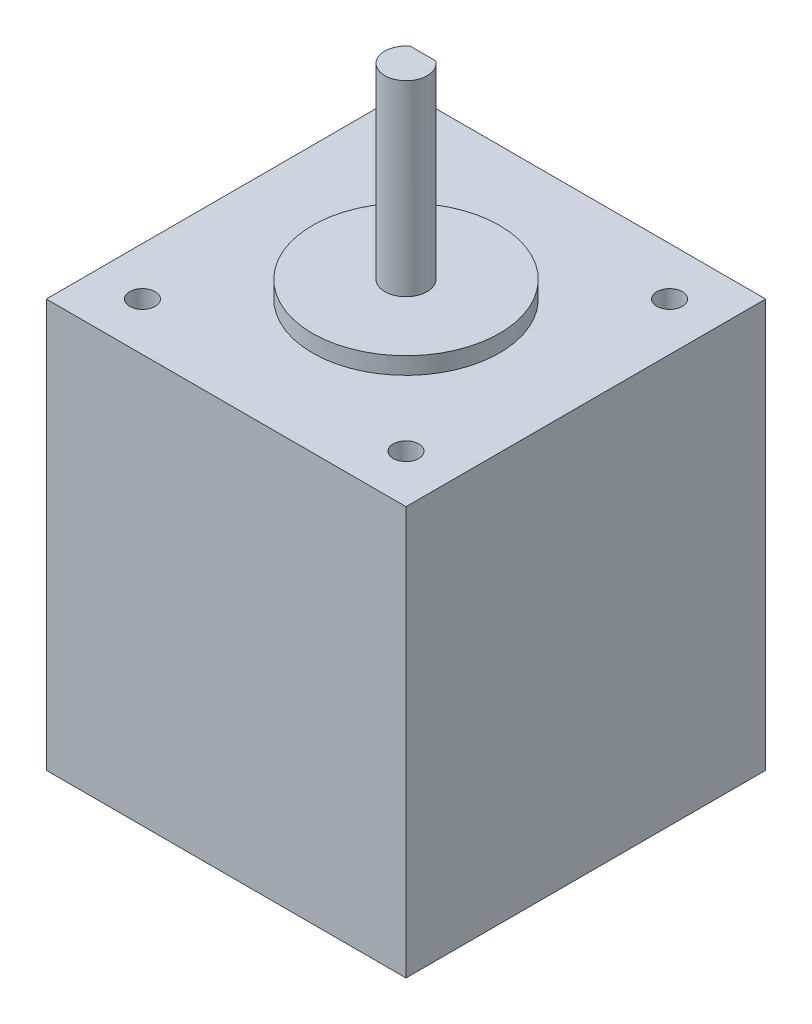
ISO-10303-21;
HEADER;
FILE_DESCRIPTION(('STEP AP214'),'2;1');
FILE_NAME('part.step','',(''),(''),'','','');
FILE_SCHEMA(('AUTOMOTIVE_DESIGN { 1 0 10303 214 1 1 1 1 }'));
ENDSEC;
DATA;
#1=APPLICATION_CONTEXT('core data for automotive mechanical design processes');
#2=APPLICATION_PROTOCOL_DEFINITION('international standard','automotive_design',2000,#1);
#3=PRODUCT_CONTEXT('',#1,'mechanical');
#4=PRODUCT('Part','Part','',(#3));
#5=PRODUCT_RELATED_PRODUCT_CATEGORY('part','',(#4));
#6=PRODUCT_DEFINITION_FORMATION('','',#4);
#7=PRODUCT_DEFINITION_CONTEXT('part definition',#1,'design');
#8=PRODUCT_DEFINITION('design','',#6,#7);
#9=PRODUCT_DEFINITION_SHAPE('','',#8);
#10=(LENGTH_UNIT() NAMED_UNIT(*) SI_UNIT(.MILLI.,.METRE.));
#11=(NAMED_UNIT(*) PLANE_ANGLE_UNIT() SI_UNIT($,.RADIAN.));
#12=(NAMED_UNIT(*) SI_UNIT($,.STERADIAN.) SOLID_ANGLE_UNIT());
#13=UNCERTAINTY_MEASURE_WITH_UNIT(LENGTH_MEASURE(1.E-05),#10,'distance_accuracy_value','');
#14=(GEOMETRIC_REPRESENTATION_CONTEXT(3) GLOBAL_UNCERTAINTY_ASSIGNED_CONTEXT((#13)) GLOBAL_UNIT_ASSIGNED_CONTEXT((#10,
#11,#12)) REPRESENTATION_CONTEXT('',''));
#15=CARTESIAN_POINT('',(0.,0.,0.));
#16=DIRECTION('',(0.,0.,1.));
#17=DIRECTION('',(1.,0.,0.));
#18=AXIS2_PLACEMENT_3D('',#15,#16,#17);
#19=CARTESIAN_POINT('',(21.15,48.,-21.15));
#20=DIRECTION('',(-1.,0.,0.));
#21=DIRECTION('',(0.,0.,1.));
#22=AXIS2_PLACEMENT_3D('',#19,#20,#21);
#23=PLANE('',#22);
#24=DIRECTION('',(0.,0.,-1.));
#25=VECTOR('',#24,1.);
#26=CARTESIAN_POINT('',(21.15,0.,-21.15));
#27=LINE('',#26,#25);
#28=CARTESIAN_POINT('',(21.15,0.,21.15));
#29=VERTEX_POINT('',#28);
#30=CARTESIAN_POINT('',(21.15,0.,-21.15));
#31=VERTEX_POINT('',#30);
#32=EDGE_CURVE('E143',#29,#31,#27,.T.);
#33=ORIENTED_EDGE('',*,*,#32,.T.);
#34=DIRECTION('',(0.,-1.,0.));
#35=VECTOR('',#34,1.);
#36=CARTESIAN_POINT('',(21.15,48.,-21.15));
#37=LINE('',#36,#35);
#38=CARTESIAN_POINT('',(21.15,48.,-21.15));
#39=VERTEX_POINT('',#38);
#40=EDGE_CURVE('E40',#39,#31,#37,.T.);
#41=ORIENTED_EDGE('',*,*,#40,.F.);
#42=DIRECTION('',(0.,0.,-1.));
#43=VECTOR('',#42,1.);
#44=CARTESIAN_POINT('',(21.15,48.,-21.15));
#45=LINE('',#44,#43);
#46=CARTESIAN_POINT('',(21.15,48.,21.15));
#47=VERTEX_POINT('',#46);
#48=EDGE_CURVE('E145',#47,#39,#45,.T.);
#49=ORIENTED_EDGE('',*,*,#48,.F.);
#50=DIRECTION('',(0.,-1.,0.));
#51=VECTOR('',#50,1.);
#52=CARTESIAN_POINT('',(21.15,48.,21.15));
#53=LINE('',#52,#51);
#54=EDGE_CURVE('E151',#47,#29,#53,.T.);
#55=ORIENTED_EDGE('',*,*,#54,.T.);
#56=EDGE_LOOP('',(#33,#41,#49,#55));
#57=FACE_BOUND('',#56,.T.);
#58=ADVANCED_FACE('F32',(#57),#23,.F.);
#59=CARTESIAN_POINT('',(-21.15,48.,-21.15));
#60=DIRECTION('',(0.,0.,1.));
#61=DIRECTION('',(1.,0.,0.));
#62=AXIS2_PLACEMENT_3D('',#59,#60,#61);
#63=PLANE('',#62);
#64=DIRECTION('',(-1.,0.,0.));
#65=VECTOR('',#64,1.);
#66=CARTESIAN_POINT('',(-21.15,0.,-21.15));
#67=LINE('',#66,#65);
#68=CARTESIAN_POINT('',(-21.15,0.,-21.15));
#69=VERTEX_POINT('',#68);
#70=EDGE_CURVE('E154',#31,#69,#67,.T.);
#71=ORIENTED_EDGE('',*,*,#70,.T.);
#72=DIRECTION('',(0.,-1.,0.));
#73=VECTOR('',#72,1.);
#74=CARTESIAN_POINT('',(-21.15,48.,-21.15));
#75=LINE('',#74,#73);
#76=CARTESIAN_POINT('',(-21.15,48.,-21.15));
#77=VERTEX_POINT('',#76);
#78=EDGE_CURVE('E162',#77,#69,#75,.T.);
#79=ORIENTED_EDGE('',*,*,#78,.F.);
#80=DIRECTION('',(-1.,0.,0.));
#81=VECTOR('',#80,1.);
#82=CARTESIAN_POINT('',(-21.15,48.,-21.15));
#83=LINE('',#82,#81);
#84=EDGE_CURVE('E86',#39,#77,#83,.T.);
#85=ORIENTED_EDGE('',*,*,#84,.F.);
#86=ORIENTED_EDGE('',*,*,#40,.T.);
#87=EDGE_LOOP('',(#71,#79,#85,#86));
#88=FACE_BOUND('',#87,.T.);
#89=ADVANCED_FACE('F165',(#88),#63,.F.);
#90=CARTESIAN_POINT('',(-21.15,48.,-21.15));
#91=DIRECTION('',(1.,0.,0.));
#92=DIRECTION('',(0.,0.,-1.));
#93=AXIS2_PLACEMENT_3D('',#90,#91,#92);
#94=PLANE('',#93);
#95=DIRECTION('',(0.,0.,1.));
#96=VECTOR('',#95,1.);
#97=CARTESIAN_POINT('',(-21.15,0.,-21.15));
#98=LINE('',#97,#96);
#99=CARTESIAN_POINT('',(-21.15,0.,21.15));
#100=VERTEX_POINT('',#99);
#101=EDGE_CURVE('E156',#69,#100,#98,.T.);
#102=ORIENTED_EDGE('',*,*,#101,.T.);
#103=DIRECTION('',(0.,-1.,0.));
#104=VECTOR('',#103,1.);
#105=CARTESIAN_POINT('',(-21.15,48.,21.15));
#106=LINE('',#105,#104);
#107=CARTESIAN_POINT('',(-21.15,48.,21.15));
#108=VERTEX_POINT('',#107);
#109=EDGE_CURVE('E160',#108,#100,#106,.T.);
#110=ORIENTED_EDGE('',*,*,#109,.F.);
#111=DIRECTION('',(0.,0.,1.));
#112=VECTOR('',#111,1.);
#113=CARTESIAN_POINT('',(-21.15,48.,-21.15));
#114=LINE('',#113,#112);
#115=EDGE_CURVE('E148',#77,#108,#114,.T.);
#116=ORIENTED_EDGE('',*,*,#115,.F.);
#117=ORIENTED_EDGE('',*,*,#78,.T.);
#118=EDGE_LOOP('',(#102,#110,#116,#117));
#119=FACE_BOUND('',#118,.T.);
#120=ADVANCED_FACE('F174',(#119),#94,.F.);
#121=CARTESIAN_POINT('',(-21.15,48.,21.15));
#122=DIRECTION('',(0.,0.,-1.));
#123=DIRECTION('',(-1.,0.,0.));
#124=AXIS2_PLACEMENT_3D('',#121,#122,#123);
#125=PLANE('',#124);
#126=DIRECTION('',(1.,0.,0.));
#127=VECTOR('',#126,1.);
#128=CARTESIAN_POINT('',(-21.15,0.,21.15));
#129=LINE('',#128,#127);
#130=EDGE_CURVE('E78',#100,#29,#129,.T.);
#131=ORIENTED_EDGE('',*,*,#130,.T.);
#132=ORIENTED_EDGE('',*,*,#54,.F.);
#133=DIRECTION('',(1.,0.,0.));
#134=VECTOR('',#133,1.);
#135=CARTESIAN_POINT('',(-21.15,48.,21.15));
#136=LINE('',#135,#134);
#137=EDGE_CURVE('E57',#108,#47,#136,.T.);
#138=ORIENTED_EDGE('',*,*,#137,.F.);
#139=ORIENTED_EDGE('',*,*,#109,.T.);
#140=EDGE_LOOP('',(#131,#132,#138,#139));
#141=FACE_BOUND('',#140,.T.);
#142=ADVANCED_FACE('F176',(#141),#125,.F.);
#143=CARTESIAN_POINT('',(0.,48.,0.));
#144=DIRECTION('',(0.,1.,0.));
#145=DIRECTION('',(0.,0.,1.));
#146=AXIS2_PLACEMENT_3D('',#143,#144,#145);
#147=PLANE('',#146);
#148=CARTESIAN_POINT('',(15.5,48.,15.5));
#149=DIRECTION('',(0.,1.,0.));
#150=DIRECTION('',(0.,0.,-1.));
#151=AXIS2_PLACEMENT_3D('',#148,#149,#150);
#152=CIRCLE('',#151,1.5);
#153=CARTESIAN_POINT('',(15.5,48.,14.));
#154=VERTEX_POINT('',#153);
#155=EDGE_CURVE('E127',#154,#154,#152,.T.);
#156=ORIENTED_EDGE('',*,*,#155,.F.);
#157=EDGE_LOOP('',(#156));
#158=FACE_BOUND('',#157,.T.);
#159=CARTESIAN_POINT('',(-15.5,48.,-15.5));
#160=DIRECTION('',(0.,1.,0.));
#161=DIRECTION('',(0.,0.,-1.));
#162=AXIS2_PLACEMENT_3D('',#159,#160,#161);
#163=CIRCLE('',#162,1.5);
#164=CARTESIAN_POINT('',(-15.5,48.,-17.));
#165=VERTEX_POINT('',#164);
#166=EDGE_CURVE('E120',#165,#165,#163,.T.);
#167=ORIENTED_EDGE('',*,*,#166,.F.);
#168=EDGE_LOOP('',(#167));
#169=FACE_BOUND('',#168,.T.);
#170=CARTESIAN_POINT('',(-15.5,48.,15.5));
#171=DIRECTION('',(0.,1.,0.));
#172=DIRECTION('',(0.,0.,1.));
#173=AXIS2_PLACEMENT_3D('',#170,#171,#172);
#174=CIRCLE('',#173,1.5);
#175=CARTESIAN_POINT('',(-15.5,48.,17.));
#176=VERTEX_POINT('',#175);
#177=EDGE_CURVE('E113',#176,#176,#174,.T.);
#178=ORIENTED_EDGE('',*,*,#177,.F.);
#179=EDGE_LOOP('',(#178));
#180=FACE_BOUND('',#179,.T.);
#181=CARTESIAN_POINT('',(15.5,48.,-15.5));
#182=DIRECTION('',(0.,1.,0.));
#183=DIRECTION('',(0.,0.,1.));
#184=AXIS2_PLACEMENT_3D('',#181,#182,#183);
#185=CIRCLE('',#184,1.5);
#186=CARTESIAN_POINT('',(15.5,48.,-14.));
#187=VERTEX_POINT('',#186);
#188=EDGE_CURVE('E126',#187,#187,#185,.T.);
#189=ORIENTED_EDGE('',*,*,#188,.F.);
#190=EDGE_LOOP('',(#189));
#191=FACE_BOUND('',#190,.T.);
#192=CARTESIAN_POINT('',(0.,48.,0.));
#193=DIRECTION('',(0.,1.,0.));
#194=DIRECTION('',(0.,0.,1.));
#195=AXIS2_PLACEMENT_3D('',#192,#193,#194);
#196=CIRCLE('',#195,11.);
#197=CARTESIAN_POINT('',(0.,48.,11.));
#198=VERTEX_POINT('',#197);
#199=EDGE_CURVE('E11',#198,#198,#196,.T.);
#200=ORIENTED_EDGE('',*,*,#199,.F.);
#201=EDGE_LOOP('',(#200));
#202=FACE_BOUND('',#201,.T.);
#203=ORIENTED_EDGE('',*,*,#48,.T.);
#204=ORIENTED_EDGE('',*,*,#84,.T.);
#205=ORIENTED_EDGE('',*,*,#115,.T.);
#206=ORIENTED_EDGE('',*,*,#137,.T.);
#207=EDGE_LOOP('',(#203,#204,#205,#206));
#208=FACE_BOUND('',#207,.T.);
#209=ADVANCED_FACE('F177',(#158,#169,#180,#191,#202,#208),#147,.T.);
#210=CARTESIAN_POINT('',(0.,0.,0.));
#211=DIRECTION('',(0.,1.,0.));
#212=DIRECTION('',(0.,0.,1.));
#213=AXIS2_PLACEMENT_3D('',#210,#211,#212);
#214=PLANE('',#213);
#215=ORIENTED_EDGE('',*,*,#32,.F.);
#216=ORIENTED_EDGE('',*,*,#130,.F.);
#217=ORIENTED_EDGE('',*,*,#101,.F.);
#218=ORIENTED_EDGE('',*,*,#70,.F.);
#219=EDGE_LOOP('',(#215,#216,#217,#218));
#220=FACE_BOUND('',#219,.T.);
#221=ADVANCED_FACE('F170',(#220),#214,.F.);
#222=CARTESIAN_POINT('',(0.,50.,0.));
#223=DIRECTION('',(0.,-1.,0.));
#224=DIRECTION('',(0.,0.,-1.));
#225=AXIS2_PLACEMENT_3D('',#222,#223,#224);
#226=CYLINDRICAL_SURFACE('',#225,11.);
#227=CARTESIAN_POINT('',(0.,50.,0.));
#228=DIRECTION('',(0.,1.,0.));
#229=DIRECTION('',(0.,0.,1.));
#230=AXIS2_PLACEMENT_3D('',#227,#228,#229);
#231=CIRCLE('',#230,11.);
#232=CARTESIAN_POINT('',(0.,50.,11.));
#233=VERTEX_POINT('',#232);
#234=EDGE_CURVE('E141',#233,#233,#231,.T.);
#235=ORIENTED_EDGE('',*,*,#234,.F.);
#236=EDGE_LOOP('',(#235));
#237=FACE_BOUND('',#236,.T.);
#238=ORIENTED_EDGE('',*,*,#199,.T.);
#239=EDGE_LOOP('',(#238));
#240=FACE_BOUND('',#239,.T.);
#241=ADVANCED_FACE('F185',(#237,#240),#226,.T.);
#242=CARTESIAN_POINT('',(0.,50.,0.));
#243=DIRECTION('',(0.,1.,0.));
#244=DIRECTION('',(0.,0.,1.));
#245=AXIS2_PLACEMENT_3D('',#242,#243,#244);
#246=PLANE('',#245);
#247=CARTESIAN_POINT('',(0.,50.,0.));
#248=DIRECTION('',(0.,1.,0.));
#249=DIRECTION('',(0.,0.,1.));
#250=AXIS2_PLACEMENT_3D('',#247,#248,#249);
#251=CIRCLE('',#250,2.5);
#252=CARTESIAN_POINT('',(0.,50.,2.5));
#253=VERTEX_POINT('',#252);
#254=EDGE_CURVE('E35',#253,#253,#251,.F.);
#255=ORIENTED_EDGE('',*,*,#254,.T.);
#256=EDGE_LOOP('',(#255));
#257=FACE_BOUND('',#256,.T.);
#258=ORIENTED_EDGE('',*,*,#234,.T.);
#259=EDGE_LOOP('',(#258));
#260=FACE_BOUND('',#259,.T.);
#261=ADVANCED_FACE('F221',(#257,#260),#246,.T.);
#262=CARTESIAN_POINT('',(0.,72.,0.));
#263=DIRECTION('',(0.,-1.,0.));
#264=DIRECTION('',(0.,0.,-1.));
#265=AXIS2_PLACEMENT_3D('',#262,#263,#264);
#266=CYLINDRICAL_SURFACE('',#265,2.5);
#267=CARTESIAN_POINT('',(0.,72.,0.));
#268=DIRECTION('',(0.,1.,0.));
#269=DIRECTION('',(0.,0.,1.));
#270=AXIS2_PLACEMENT_3D('',#267,#268,#269);
#271=CIRCLE('',#270,2.5);
#272=CARTESIAN_POINT('',(-1.5,72.,-2.));
#273=VERTEX_POINT('',#272);
#274=CARTESIAN_POINT('',(1.5,72.,-2.));
#275=VERTEX_POINT('',#274);
#276=EDGE_CURVE('E111',#273,#275,#271,.T.);
#277=ORIENTED_EDGE('',*,*,#276,.F.);
#278=DIRECTION('',(0.,1.,0.));
#279=VECTOR('',#278,1.);
#280=CARTESIAN_POINT('',(-1.5,52.,-2.));
#281=LINE('',#280,#279);
#282=CARTESIAN_POINT('',(-1.5,52.,-2.));
#283=VERTEX_POINT('',#282);
#284=EDGE_CURVE('E48',#283,#273,#281,.T.);
#285=ORIENTED_EDGE('',*,*,#284,.F.);
#286=CARTESIAN_POINT('',(0.,52.,0.));
#287=DIRECTION('',(0.,1.,0.));
#288=DIRECTION('',(0.,0.,1.));
#289=AXIS2_PLACEMENT_3D('',#286,#287,#288);
#290=CIRCLE('',#289,2.5);
#291=CARTESIAN_POINT('',(1.5,52.,-2.));
#292=VERTEX_POINT('',#291);
#293=EDGE_CURVE('E97',#292,#283,#290,.T.);
#294=ORIENTED_EDGE('',*,*,#293,.F.);
#295=DIRECTION('',(0.,1.,0.));
#296=VECTOR('',#295,1.);
#297=CARTESIAN_POINT('',(1.5,52.,-2.));
#298=LINE('',#297,#296);
#299=EDGE_CURVE('E105',#292,#275,#298,.T.);
#300=ORIENTED_EDGE('',*,*,#299,.T.);
#301=EDGE_LOOP('',(#277,#285,#294,#300));
#302=FACE_BOUND('',#301,.T.);
#303=ORIENTED_EDGE('',*,*,#254,.F.);
#304=EDGE_LOOP('',(#303));
#305=FACE_BOUND('',#304,.T.);
#306=ADVANCED_FACE('F108',(#302,#305),#266,.T.);
#307=CARTESIAN_POINT('',(0.,72.,0.));
#308=DIRECTION('',(0.,1.,0.));
#309=DIRECTION('',(0.,0.,1.));
#310=AXIS2_PLACEMENT_3D('',#307,#308,#309);
#311=PLANE('',#310);
#312=DIRECTION('',(1.,0.,0.));
#313=VECTOR('',#312,1.);
#314=CARTESIAN_POINT('',(0.,72.,-2.));
#315=LINE('',#314,#313);
#316=EDGE_CURVE('E102',#273,#275,#315,.T.);
#317=ORIENTED_EDGE('',*,*,#316,.F.);
#318=ORIENTED_EDGE('',*,*,#276,.T.);
#319=EDGE_LOOP('',(#317,#318));
#320=FACE_BOUND('',#319,.T.);
#321=ADVANCED_FACE('F246',(#320),#311,.T.);
#322=CARTESIAN_POINT('',(15.5,44.,-15.5));
#323=DIRECTION('',(0.,1.,0.));
#324=DIRECTION('',(0.,0.,1.));
#325=AXIS2_PLACEMENT_3D('',#322,#323,#324);
#326=CYLINDRICAL_SURFACE('',#325,1.5);
#327=CARTESIAN_POINT('',(15.5,44.,-15.5));
#328=DIRECTION('',(0.,1.,0.));
#329=DIRECTION('',(0.,0.,1.));
#330=AXIS2_PLACEMENT_3D('',#327,#328,#329);
#331=CIRCLE('',#330,1.5);
#332=CARTESIAN_POINT('',(15.5,44.,-14.));
#333=VERTEX_POINT('',#332);
#334=EDGE_CURVE('E135',#333,#333,#331,.T.);
#335=ORIENTED_EDGE('',*,*,#334,.F.);
#336=EDGE_LOOP('',(#335));
#337=FACE_BOUND('',#336,.T.);
#338=ORIENTED_EDGE('',*,*,#188,.T.);
#339=EDGE_LOOP('',(#338));
#340=FACE_BOUND('',#339,.T.);
#341=ADVANCED_FACE('F240',(#337,#340),#326,.F.);
#342=CARTESIAN_POINT('',(15.5,44.,-15.5));
#343=DIRECTION('',(0.,1.,0.));
#344=DIRECTION('',(0.,0.,1.));
#345=AXIS2_PLACEMENT_3D('',#342,#343,#344);
#346=PLANE('',#345);
#347=ORIENTED_EDGE('',*,*,#334,.T.);
#348=EDGE_LOOP('',(#347));
#349=FACE_BOUND('',#348,.T.);
#350=ADVANCED_FACE('F245',(#349),#346,.T.);
#351=CARTESIAN_POINT('',(-15.5,44.,15.5));
#352=DIRECTION('',(0.,1.,0.));
#353=DIRECTION('',(0.,0.,1.));
#354=AXIS2_PLACEMENT_3D('',#351,#352,#353);
#355=CYLINDRICAL_SURFACE('',#354,1.5);
#356=CARTESIAN_POINT('',(-15.5,44.,15.5));
#357=DIRECTION('',(0.,1.,0.));
#358=DIRECTION('',(0.,0.,1.));
#359=AXIS2_PLACEMENT_3D('',#356,#357,#358);
#360=CIRCLE('',#359,1.5);
#361=CARTESIAN_POINT('',(-15.5,44.,17.));
#362=VERTEX_POINT('',#361);
#363=EDGE_CURVE('E117',#362,#362,#360,.T.);
#364=ORIENTED_EDGE('',*,*,#363,.F.);
#365=EDGE_LOOP('',(#364));
#366=FACE_BOUND('',#365,.T.);
#367=ORIENTED_EDGE('',*,*,#177,.T.);
#368=EDGE_LOOP('',(#367));
#369=FACE_BOUND('',#368,.T.);
#370=ADVANCED_FACE('F258',(#366,#369),#355,.F.);
#371=CARTESIAN_POINT('',(-15.5,44.,15.5));
#372=DIRECTION('',(0.,1.,0.));
#373=DIRECTION('',(0.,0.,1.));
#374=AXIS2_PLACEMENT_3D('',#371,#372,#373);
#375=PLANE('',#374);
#376=ORIENTED_EDGE('',*,*,#363,.T.);
#377=EDGE_LOOP('',(#376));
#378=FACE_BOUND('',#377,.T.);
#379=ADVANCED_FACE('F268',(#378),#375,.T.);
#380=CARTESIAN_POINT('',(-15.5,44.,-15.5));
#381=DIRECTION('',(0.,1.,0.));
#382=DIRECTION('',(0.,0.,1.));
#383=AXIS2_PLACEMENT_3D('',#380,#381,#382);
#384=CYLINDRICAL_SURFACE('',#383,1.5);
#385=CARTESIAN_POINT('',(-15.5,44.,-15.5));
#386=DIRECTION('',(0.,1.,0.));
#387=DIRECTION('',(0.,0.,-1.));
#388=AXIS2_PLACEMENT_3D('',#385,#386,#387);
#389=CIRCLE('',#388,1.5);
#390=CARTESIAN_POINT('',(-15.5,44.,-17.));
#391=VERTEX_POINT('',#390);
#392=EDGE_CURVE('E130',#391,#391,#389,.T.);
#393=ORIENTED_EDGE('',*,*,#392,.F.);
#394=EDGE_LOOP('',(#393));
#395=FACE_BOUND('',#394,.T.);
#396=ORIENTED_EDGE('',*,*,#166,.T.);
#397=EDGE_LOOP('',(#396));
#398=FACE_BOUND('',#397,.T.);
#399=ADVANCED_FACE('F278',(#395,#398),#384,.F.);
#400=CARTESIAN_POINT('',(-15.5,44.,-15.5));
#401=DIRECTION('',(0.,-1.,0.));
#402=DIRECTION('',(0.,0.,-1.));
#403=AXIS2_PLACEMENT_3D('',#400,#401,#402);
#404=PLANE('',#403);
#405=ORIENTED_EDGE('',*,*,#392,.T.);
#406=EDGE_LOOP('',(#405));
#407=FACE_BOUND('',#406,.T.);
#408=ADVANCED_FACE('F288',(#407),#404,.F.);
#409=CARTESIAN_POINT('',(15.5,44.,15.5));
#410=DIRECTION('',(0.,1.,0.));
#411=DIRECTION('',(0.,0.,1.));
#412=AXIS2_PLACEMENT_3D('',#409,#410,#411);
#413=CYLINDRICAL_SURFACE('',#412,1.5);
#414=CARTESIAN_POINT('',(15.5,44.,15.5));
#415=DIRECTION('',(0.,1.,0.));
#416=DIRECTION('',(0.,0.,-1.));
#417=AXIS2_PLACEMENT_3D('',#414,#415,#416);
#418=CIRCLE('',#417,1.5);
#419=CARTESIAN_POINT('',(15.5,44.,14.));
#420=VERTEX_POINT('',#419);
#421=EDGE_CURVE('E123',#420,#420,#418,.T.);
#422=ORIENTED_EDGE('',*,*,#421,.F.);
#423=EDGE_LOOP('',(#422));
#424=FACE_BOUND('',#423,.T.);
#425=ORIENTED_EDGE('',*,*,#155,.T.);
#426=EDGE_LOOP('',(#425));
#427=FACE_BOUND('',#426,.T.);
#428=ADVANCED_FACE('F298',(#424,#427),#413,.F.);
#429=CARTESIAN_POINT('',(15.5,44.,15.5));
#430=DIRECTION('',(0.,-1.,0.));
#431=DIRECTION('',(0.,0.,-1.));
#432=AXIS2_PLACEMENT_3D('',#429,#430,#431);
#433=PLANE('',#432);
#434=ORIENTED_EDGE('',*,*,#421,.T.);
#435=EDGE_LOOP('',(#434));
#436=FACE_BOUND('',#435,.T.);
#437=ADVANCED_FACE('F308',(#436),#433,.F.);
#438=CARTESIAN_POINT('',(0.,52.,-2.));
#439=DIRECTION('',(0.,0.,1.));
#440=DIRECTION('',(1.,0.,0.));
#441=AXIS2_PLACEMENT_3D('',#438,#439,#440);
#442=PLANE('',#441);
#443=ORIENTED_EDGE('',*,*,#316,.T.);
#444=ORIENTED_EDGE('',*,*,#299,.F.);
#445=DIRECTION('',(1.,0.,0.));
#446=VECTOR('',#445,1.);
#447=CARTESIAN_POINT('',(0.,52.,-2.));
#448=LINE('',#447,#446);
#449=EDGE_CURVE('E99',#283,#292,#448,.T.);
#450=ORIENTED_EDGE('',*,*,#449,.F.);
#451=ORIENTED_EDGE('',*,*,#284,.T.);
#452=EDGE_LOOP('',(#443,#444,#450,#451));
#453=FACE_BOUND('',#452,.T.);
#454=ADVANCED_FACE('F104',(#453),#442,.F.);
#455=CARTESIAN_POINT('',(0.,52.,0.));
#456=DIRECTION('',(0.,1.,0.));
#457=DIRECTION('',(0.,0.,1.));
#458=AXIS2_PLACEMENT_3D('',#455,#456,#457);
#459=PLANE('',#458);
#460=ORIENTED_EDGE('',*,*,#293,.T.);
#461=ORIENTED_EDGE('',*,*,#449,.T.);
#462=EDGE_LOOP('',(#460,#461));
#463=FACE_BOUND('',#462,.T.);
#464=ADVANCED_FACE('F98',(#463),#459,.T.);
#465=CLOSED_SHELL('',(#58,#89,#120,#142,#209,#221,#241,#261,#306,#321,#341,#350,#370,#379,#399,
#408,#428,#437,#454,#464));
#466=MANIFOLD_SOLID_BREP('B2',#465);
#467=ADVANCED_BREP_SHAPE_REPRESENTATION('',(#18,#466),#14);
#468=SHAPE_DEFINITION_REPRESENTATION(#9,#467);
ENDSEC;
END-ISO-10303-21;
